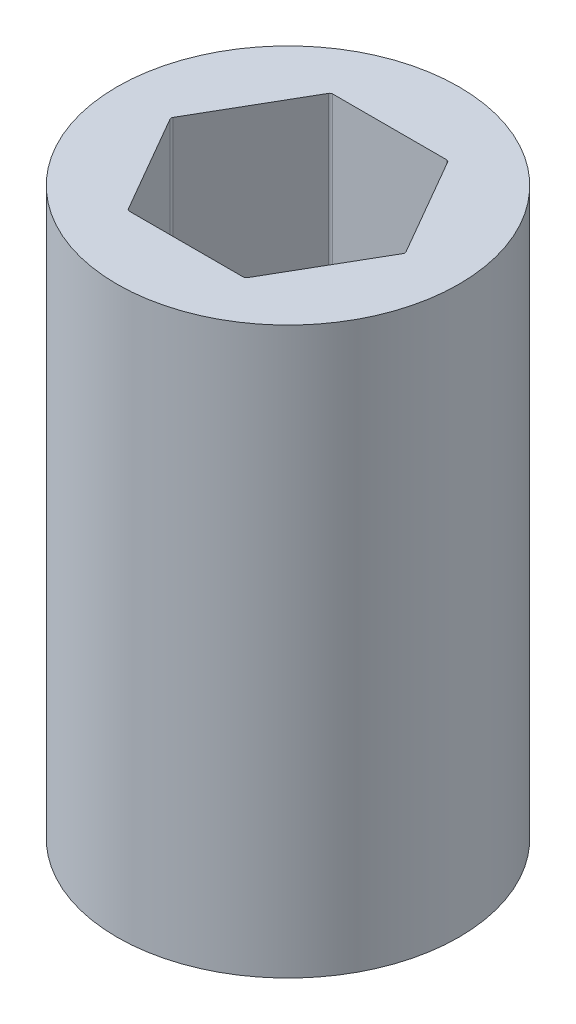
ISO-10303-21;
HEADER;
FILE_DESCRIPTION(('STEP AP214'),'2;1');
FILE_NAME('part.step','',(''),(''),'','','');
FILE_SCHEMA(('AUTOMOTIVE_DESIGN { 1 0 10303 214 1 1 1 1 }'));
ENDSEC;
DATA;
#1=APPLICATION_CONTEXT('core data for automotive mechanical design processes');
#2=APPLICATION_PROTOCOL_DEFINITION('international standard','automotive_design',2000,#1);
#3=PRODUCT_CONTEXT('',#1,'mechanical');
#4=PRODUCT('Part','Part','',(#3));
#5=PRODUCT_RELATED_PRODUCT_CATEGORY('part','',(#4));
#6=PRODUCT_DEFINITION_FORMATION('','',#4);
#7=PRODUCT_DEFINITION_CONTEXT('part definition',#1,'design');
#8=PRODUCT_DEFINITION('design','',#6,#7);
#9=PRODUCT_DEFINITION_SHAPE('','',#8);
#10=(LENGTH_UNIT() NAMED_UNIT(*) SI_UNIT(.MILLI.,.METRE.));
#11=(NAMED_UNIT(*) PLANE_ANGLE_UNIT() SI_UNIT($,.RADIAN.));
#12=(NAMED_UNIT(*) SI_UNIT($,.STERADIAN.) SOLID_ANGLE_UNIT());
#13=UNCERTAINTY_MEASURE_WITH_UNIT(LENGTH_MEASURE(1.E-05),#10,'distance_accuracy_value','');
#14=(GEOMETRIC_REPRESENTATION_CONTEXT(3) GLOBAL_UNCERTAINTY_ASSIGNED_CONTEXT((#13)) GLOBAL_UNIT_ASSIGNED_CONTEXT((#10,
#11,#12)) REPRESENTATION_CONTEXT('',''));
#15=CARTESIAN_POINT('',(0.,0.,0.));
#16=DIRECTION('',(0.,0.,1.));
#17=DIRECTION('',(1.,0.,0.));
#18=AXIS2_PLACEMENT_3D('',#15,#16,#17);
#19=CARTESIAN_POINT('',(0.,36.7538,0.));
#20=DIRECTION('',(0.,1.,0.));
#21=DIRECTION('',(0.,0.,1.));
#22=AXIS2_PLACEMENT_3D('',#19,#20,#21);
#23=PLANE('',#22);
#24=CARTESIAN_POINT('',(0.,36.7538,0.));
#25=DIRECTION('',(0.,1.,0.));
#26=DIRECTION('',(0.,0.,1.));
#27=AXIS2_PLACEMENT_3D('',#24,#25,#26);
#28=CIRCLE('',#27,11.1125);
#29=CARTESIAN_POINT('',(0.,36.7538,11.1125));
#30=VERTEX_POINT('',#29);
#31=EDGE_CURVE('E147',#30,#30,#28,.T.);
#32=ORIENTED_EDGE('',*,*,#31,.T.);
#33=EDGE_LOOP('',(#32));
#34=FACE_BOUND('',#33,.T.);
#35=DIRECTION('',(-0.5,0.,-0.866025403784438));
#36=VECTOR('',#35,1.);
#37=CARTESIAN_POINT('',(7.62564235545658,36.7538,0.));
#38=LINE('',#37,#36);
#39=CARTESIAN_POINT('',(7.56790732853761,36.7538,-0.100000000000002));
#40=VERTEX_POINT('',#39);
#41=CARTESIAN_POINT('',(3.87055620464725,36.7538,-6.504));
#42=VERTEX_POINT('',#41);
#43=EDGE_CURVE('E248',#40,#42,#38,.T.);
#44=ORIENTED_EDGE('',*,*,#43,.F.);
#45=CARTESIAN_POINT('',(7.39470224778073,36.7538,0.));
#46=DIRECTION('',(0.,1.,0.));
#47=DIRECTION('',(0.,0.,1.));
#48=AXIS2_PLACEMENT_3D('',#45,#46,#47);
#49=CIRCLE('',#48,0.2);
#50=CARTESIAN_POINT('',(7.56790732853761,36.7538,0.0999999999999985));
#51=VERTEX_POINT('',#50);
#52=EDGE_CURVE('E50',#40,#51,#49,.F.);
#53=ORIENTED_EDGE('',*,*,#52,.T.);
#54=DIRECTION('',(0.5,0.,-0.866025403784439));
#55=VECTOR('',#54,1.);
#56=CARTESIAN_POINT('',(3.81282117772829,36.7538,6.604));
#57=LINE('',#56,#55);
#58=CARTESIAN_POINT('',(3.87055620464725,36.7538,6.50400000000001));
#59=VERTEX_POINT('',#58);
#60=EDGE_CURVE('E206',#59,#51,#57,.T.);
#61=ORIENTED_EDGE('',*,*,#60,.F.);
#62=CARTESIAN_POINT('',(3.69735112389036,36.7538,6.40400000000001));
#63=DIRECTION('',(0.,1.,0.));
#64=DIRECTION('',(0.,0.,1.));
#65=AXIS2_PLACEMENT_3D('',#62,#63,#64);
#66=CIRCLE('',#65,0.2);
#67=CARTESIAN_POINT('',(3.69735112389036,36.7538,6.604));
#68=VERTEX_POINT('',#67);
#69=EDGE_CURVE('E135',#59,#68,#66,.F.);
#70=ORIENTED_EDGE('',*,*,#69,.T.);
#71=DIRECTION('',(1.,0.,0.));
#72=VECTOR('',#71,1.);
#73=CARTESIAN_POINT('',(-3.81282117772829,36.7538,6.604));
#74=LINE('',#73,#72);
#75=CARTESIAN_POINT('',(-3.69735112389036,36.7538,6.604));
#76=VERTEX_POINT('',#75);
#77=EDGE_CURVE('E213',#76,#68,#74,.T.);
#78=ORIENTED_EDGE('',*,*,#77,.F.);
#79=CARTESIAN_POINT('',(-3.69735112389036,36.7538,6.40400000000001));
#80=DIRECTION('',(0.,1.,0.));
#81=DIRECTION('',(0.,0.,1.));
#82=AXIS2_PLACEMENT_3D('',#79,#80,#81);
#83=CIRCLE('',#82,0.2);
#84=CARTESIAN_POINT('',(-3.87055620464725,36.7538,6.50400000000001));
#85=VERTEX_POINT('',#84);
#86=EDGE_CURVE('E11',#76,#85,#83,.F.);
#87=ORIENTED_EDGE('',*,*,#86,.T.);
#88=DIRECTION('',(0.5,0.,0.866025403784439));
#89=VECTOR('',#88,1.);
#90=CARTESIAN_POINT('',(-7.62564235545658,36.7538,0.));
#91=LINE('',#90,#89);
#92=CARTESIAN_POINT('',(-7.56790732853762,36.7538,0.100000000000001));
#93=VERTEX_POINT('',#92);
#94=EDGE_CURVE('E211',#93,#85,#91,.T.);
#95=ORIENTED_EDGE('',*,*,#94,.F.);
#96=CARTESIAN_POINT('',(-7.39470224778073,36.7538,0.));
#97=DIRECTION('',(0.,1.,0.));
#98=DIRECTION('',(0.,0.,1.));
#99=AXIS2_PLACEMENT_3D('',#96,#97,#98);
#100=CIRCLE('',#99,0.2);
#101=CARTESIAN_POINT('',(-7.56790732853762,36.7538,-0.0999999999999994));
#102=VERTEX_POINT('',#101);
#103=EDGE_CURVE('E188',#93,#102,#100,.F.);
#104=ORIENTED_EDGE('',*,*,#103,.T.);
#105=DIRECTION('',(-0.5,0.,0.866025403784439));
#106=VECTOR('',#105,1.);
#107=CARTESIAN_POINT('',(-3.81282117772829,36.7538,-6.604));
#108=LINE('',#107,#106);
#109=CARTESIAN_POINT('',(-3.87055620464725,36.7538,-6.504));
#110=VERTEX_POINT('',#109);
#111=EDGE_CURVE('E217',#110,#102,#108,.T.);
#112=ORIENTED_EDGE('',*,*,#111,.F.);
#113=CARTESIAN_POINT('',(-3.69735112389037,36.7538,-6.404));
#114=DIRECTION('',(0.,1.,0.));
#115=DIRECTION('',(0.,0.,1.));
#116=AXIS2_PLACEMENT_3D('',#113,#114,#115);
#117=CIRCLE('',#116,0.2);
#118=CARTESIAN_POINT('',(-3.69735112389037,36.7538,-6.604));
#119=VERTEX_POINT('',#118);
#120=EDGE_CURVE('E184',#110,#119,#117,.F.);
#121=ORIENTED_EDGE('',*,*,#120,.T.);
#122=DIRECTION('',(-1.,0.,0.));
#123=VECTOR('',#122,1.);
#124=CARTESIAN_POINT('',(3.81282117772829,36.7538,-6.604));
#125=LINE('',#124,#123);
#126=CARTESIAN_POINT('',(3.69735112389036,36.7538,-6.604));
#127=VERTEX_POINT('',#126);
#128=EDGE_CURVE('E221',#127,#119,#125,.T.);
#129=ORIENTED_EDGE('',*,*,#128,.F.);
#130=CARTESIAN_POINT('',(3.69735112389036,36.7538,-6.404));
#131=DIRECTION('',(0.,1.,0.));
#132=DIRECTION('',(0.,0.,1.));
#133=AXIS2_PLACEMENT_3D('',#130,#131,#132);
#134=CIRCLE('',#133,0.2);
#135=EDGE_CURVE('E180',#127,#42,#134,.F.);
#136=ORIENTED_EDGE('',*,*,#135,.T.);
#137=EDGE_LOOP('',(#44,#53,#61,#70,#78,#87,#95,#104,#112,#121,#129,#136));
#138=FACE_BOUND('',#137,.T.);
#139=ADVANCED_FACE('F35',(#34,#138),#23,.T.);
#140=CARTESIAN_POINT('',(0.,0.,0.));
#141=DIRECTION('',(0.,1.,0.));
#142=DIRECTION('',(0.,0.,1.));
#143=AXIS2_PLACEMENT_3D('',#140,#141,#142);
#144=PLANE('',#143);
#145=CARTESIAN_POINT('',(0.,0.,0.));
#146=DIRECTION('',(0.,1.,0.));
#147=DIRECTION('',(0.,0.,1.));
#148=AXIS2_PLACEMENT_3D('',#145,#146,#147);
#149=CIRCLE('',#148,11.1125);
#150=CARTESIAN_POINT('',(0.,0.,11.1125));
#151=VERTEX_POINT('',#150);
#152=EDGE_CURVE('E152',#151,#151,#149,.T.);
#153=ORIENTED_EDGE('',*,*,#152,.F.);
#154=EDGE_LOOP('',(#153));
#155=FACE_BOUND('',#154,.T.);
#156=DIRECTION('',(1.,0.,0.));
#157=VECTOR('',#156,1.);
#158=CARTESIAN_POINT('',(-3.81282117772829,0.,6.604));
#159=LINE('',#158,#157);
#160=CARTESIAN_POINT('',(-3.69735112389036,0.,6.604));
#161=VERTEX_POINT('',#160);
#162=CARTESIAN_POINT('',(3.69735112389036,0.,6.604));
#163=VERTEX_POINT('',#162);
#164=EDGE_CURVE('E195',#161,#163,#159,.T.);
#165=ORIENTED_EDGE('',*,*,#164,.T.);
#166=CARTESIAN_POINT('',(3.69735112389036,0.,6.40400000000001));
#167=DIRECTION('',(0.,1.,0.));
#168=DIRECTION('',(0.,0.,1.));
#169=AXIS2_PLACEMENT_3D('',#166,#167,#168);
#170=CIRCLE('',#169,0.2);
#171=CARTESIAN_POINT('',(3.87055620464725,0.,6.50400000000001));
#172=VERTEX_POINT('',#171);
#173=EDGE_CURVE('E190',#163,#172,#170,.T.);
#174=ORIENTED_EDGE('',*,*,#173,.T.);
#175=DIRECTION('',(0.5,0.,-0.866025403784439));
#176=VECTOR('',#175,1.);
#177=CARTESIAN_POINT('',(3.81282117772829,0.,6.604));
#178=LINE('',#177,#176);
#179=CARTESIAN_POINT('',(7.56790732853761,0.,0.0999999999999985));
#180=VERTEX_POINT('',#179);
#181=EDGE_CURVE('E130',#172,#180,#178,.T.);
#182=ORIENTED_EDGE('',*,*,#181,.T.);
#183=CARTESIAN_POINT('',(7.39470224778073,0.,0.));
#184=DIRECTION('',(0.,1.,0.));
#185=DIRECTION('',(0.,0.,1.));
#186=AXIS2_PLACEMENT_3D('',#183,#184,#185);
#187=CIRCLE('',#186,0.2);
#188=CARTESIAN_POINT('',(7.56790732853761,0.,-0.100000000000002));
#189=VERTEX_POINT('',#188);
#190=EDGE_CURVE('E125',#180,#189,#187,.T.);
#191=ORIENTED_EDGE('',*,*,#190,.T.);
#192=DIRECTION('',(-0.5,0.,-0.866025403784438));
#193=VECTOR('',#192,1.);
#194=CARTESIAN_POINT('',(7.62564235545658,0.,0.));
#195=LINE('',#194,#193);
#196=CARTESIAN_POINT('',(3.87055620464725,0.,-6.504));
#197=VERTEX_POINT('',#196);
#198=EDGE_CURVE('E129',#189,#197,#195,.T.);
#199=ORIENTED_EDGE('',*,*,#198,.T.);
#200=CARTESIAN_POINT('',(3.69735112389036,0.,-6.404));
#201=DIRECTION('',(0.,1.,0.));
#202=DIRECTION('',(0.,0.,1.));
#203=AXIS2_PLACEMENT_3D('',#200,#201,#202);
#204=CIRCLE('',#203,0.2);
#205=CARTESIAN_POINT('',(3.69735112389036,0.,-6.604));
#206=VERTEX_POINT('',#205);
#207=EDGE_CURVE('E178',#197,#206,#204,.T.);
#208=ORIENTED_EDGE('',*,*,#207,.T.);
#209=DIRECTION('',(-1.,0.,0.));
#210=VECTOR('',#209,1.);
#211=CARTESIAN_POINT('',(3.81282117772829,0.,-6.604));
#212=LINE('',#211,#210);
#213=CARTESIAN_POINT('',(-3.69735112389037,0.,-6.604));
#214=VERTEX_POINT('',#213);
#215=EDGE_CURVE('E144',#206,#214,#212,.T.);
#216=ORIENTED_EDGE('',*,*,#215,.T.);
#217=CARTESIAN_POINT('',(-3.69735112389037,0.,-6.404));
#218=DIRECTION('',(0.,1.,0.));
#219=DIRECTION('',(0.,0.,1.));
#220=AXIS2_PLACEMENT_3D('',#217,#218,#219);
#221=CIRCLE('',#220,0.2);
#222=CARTESIAN_POINT('',(-3.87055620464725,0.,-6.504));
#223=VERTEX_POINT('',#222);
#224=EDGE_CURVE('E182',#214,#223,#221,.T.);
#225=ORIENTED_EDGE('',*,*,#224,.T.);
#226=DIRECTION('',(-0.5,0.,0.866025403784439));
#227=VECTOR('',#226,1.);
#228=CARTESIAN_POINT('',(-3.81282117772829,0.,-6.604));
#229=LINE('',#228,#227);
#230=CARTESIAN_POINT('',(-7.56790732853762,0.,-0.0999999999999994));
#231=VERTEX_POINT('',#230);
#232=EDGE_CURVE('E228',#223,#231,#229,.T.);
#233=ORIENTED_EDGE('',*,*,#232,.T.);
#234=CARTESIAN_POINT('',(-7.39470224778073,0.,0.));
#235=DIRECTION('',(0.,1.,0.));
#236=DIRECTION('',(0.,0.,1.));
#237=AXIS2_PLACEMENT_3D('',#234,#235,#236);
#238=CIRCLE('',#237,0.2);
#239=CARTESIAN_POINT('',(-7.56790732853762,0.,0.100000000000001));
#240=VERTEX_POINT('',#239);
#241=EDGE_CURVE('E186',#231,#240,#238,.T.);
#242=ORIENTED_EDGE('',*,*,#241,.T.);
#243=DIRECTION('',(0.5,0.,0.866025403784439));
#244=VECTOR('',#243,1.);
#245=CARTESIAN_POINT('',(-7.62564235545658,0.,0.));
#246=LINE('',#245,#244);
#247=CARTESIAN_POINT('',(-3.87055620464725,0.,6.50400000000001));
#248=VERTEX_POINT('',#247);
#249=EDGE_CURVE('E197',#240,#248,#246,.T.);
#250=ORIENTED_EDGE('',*,*,#249,.T.);
#251=CARTESIAN_POINT('',(-3.69735112389036,0.,6.40400000000001));
#252=DIRECTION('',(0.,1.,0.));
#253=DIRECTION('',(0.,0.,1.));
#254=AXIS2_PLACEMENT_3D('',#251,#252,#253);
#255=CIRCLE('',#254,0.2);
#256=EDGE_CURVE('E43',#248,#161,#255,.T.);
#257=ORIENTED_EDGE('',*,*,#256,.T.);
#258=EDGE_LOOP('',(#165,#174,#182,#191,#199,#208,#216,#225,#233,#242,#250,#257));
#259=FACE_BOUND('',#258,.T.);
#260=ADVANCED_FACE('F128',(#155,#259),#144,.F.);
#261=CARTESIAN_POINT('',(0.,36.7538,0.));
#262=DIRECTION('',(0.,-1.,0.));
#263=DIRECTION('',(0.,0.,-1.));
#264=AXIS2_PLACEMENT_3D('',#261,#262,#263);
#265=CYLINDRICAL_SURFACE('',#264,11.1125);
#266=ORIENTED_EDGE('',*,*,#31,.F.);
#267=EDGE_LOOP('',(#266));
#268=FACE_BOUND('',#267,.T.);
#269=ORIENTED_EDGE('',*,*,#152,.T.);
#270=EDGE_LOOP('',(#269));
#271=FACE_BOUND('',#270,.T.);
#272=ADVANCED_FACE('F270',(#268,#271),#265,.T.);
#273=CARTESIAN_POINT('',(3.81282117772829,36.7538,6.604));
#274=DIRECTION('',(-0.866025403784439,0.,-0.5));
#275=DIRECTION('',(-0.5,0.,0.866025403784439));
#276=AXIS2_PLACEMENT_3D('',#273,#274,#275);
#277=PLANE('',#276);
#278=ORIENTED_EDGE('',*,*,#181,.F.);
#279=DIRECTION('',(0.,-1.,0.));
#280=VECTOR('',#279,1.);
#281=CARTESIAN_POINT('',(3.87055620464725,36.7538,6.50400000000001));
#282=LINE('',#281,#280);
#283=EDGE_CURVE('E57',#172,#59,#282,.F.);
#284=ORIENTED_EDGE('',*,*,#283,.T.);
#285=ORIENTED_EDGE('',*,*,#60,.T.);
#286=DIRECTION('',(0.,-1.,0.));
#287=VECTOR('',#286,1.);
#288=CARTESIAN_POINT('',(7.56790732853761,0.,0.0999999999999983));
#289=LINE('',#288,#287);
#290=EDGE_CURVE('E175',#51,#180,#289,.T.);
#291=ORIENTED_EDGE('',*,*,#290,.T.);
#292=EDGE_LOOP('',(#278,#284,#285,#291));
#293=FACE_BOUND('',#292,.T.);
#294=ADVANCED_FACE('F251',(#293),#277,.T.);
#295=CARTESIAN_POINT('',(7.62564235545658,36.7538,0.));
#296=DIRECTION('',(-0.866025403784438,0.,0.5));
#297=DIRECTION('',(0.5,0.,0.866025403784439));
#298=AXIS2_PLACEMENT_3D('',#295,#296,#297);
#299=PLANE('',#298);
#300=ORIENTED_EDGE('',*,*,#43,.T.);
#301=DIRECTION('',(0.,-1.,0.));
#302=VECTOR('',#301,1.);
#303=CARTESIAN_POINT('',(3.87055620464725,0.,-6.504));
#304=LINE('',#303,#302);
#305=EDGE_CURVE('E143',#42,#197,#304,.T.);
#306=ORIENTED_EDGE('',*,*,#305,.T.);
#307=ORIENTED_EDGE('',*,*,#198,.F.);
#308=DIRECTION('',(0.,-1.,0.));
#309=VECTOR('',#308,1.);
#310=CARTESIAN_POINT('',(7.56790732853761,36.7538,-0.100000000000002));
#311=LINE('',#310,#309);
#312=EDGE_CURVE('E141',#189,#40,#311,.F.);
#313=ORIENTED_EDGE('',*,*,#312,.T.);
#314=EDGE_LOOP('',(#300,#306,#307,#313));
#315=FACE_BOUND('',#314,.T.);
#316=ADVANCED_FACE('F140',(#315),#299,.T.);
#317=CARTESIAN_POINT('',(3.81282117772829,36.7538,-6.604));
#318=DIRECTION('',(0.,0.,1.));
#319=DIRECTION('',(1.,0.,0.));
#320=AXIS2_PLACEMENT_3D('',#317,#318,#319);
#321=PLANE('',#320);
#322=ORIENTED_EDGE('',*,*,#215,.F.);
#323=DIRECTION('',(0.,-1.,0.));
#324=VECTOR('',#323,1.);
#325=CARTESIAN_POINT('',(3.69735112389036,36.7538,-6.604));
#326=LINE('',#325,#324);
#327=EDGE_CURVE('E158',#206,#127,#326,.F.);
#328=ORIENTED_EDGE('',*,*,#327,.T.);
#329=ORIENTED_EDGE('',*,*,#128,.T.);
#330=DIRECTION('',(0.,-1.,0.));
#331=VECTOR('',#330,1.);
#332=CARTESIAN_POINT('',(-3.69735112389037,0.,-6.604));
#333=LINE('',#332,#331);
#334=EDGE_CURVE('E149',#119,#214,#333,.T.);
#335=ORIENTED_EDGE('',*,*,#334,.T.);
#336=EDGE_LOOP('',(#322,#328,#329,#335));
#337=FACE_BOUND('',#336,.T.);
#338=ADVANCED_FACE('F246',(#337),#321,.T.);
#339=CARTESIAN_POINT('',(-3.81282117772829,36.7538,-6.604));
#340=DIRECTION('',(0.866025403784439,0.,0.5));
#341=DIRECTION('',(0.5,0.,-0.866025403784439));
#342=AXIS2_PLACEMENT_3D('',#339,#340,#341);
#343=PLANE('',#342);
#344=ORIENTED_EDGE('',*,*,#232,.F.);
#345=DIRECTION('',(0.,-1.,0.));
#346=VECTOR('',#345,1.);
#347=CARTESIAN_POINT('',(-3.87055620464725,36.7538,-6.504));
#348=LINE('',#347,#346);
#349=EDGE_CURVE('E163',#223,#110,#348,.F.);
#350=ORIENTED_EDGE('',*,*,#349,.T.);
#351=ORIENTED_EDGE('',*,*,#111,.T.);
#352=DIRECTION('',(0.,-1.,0.));
#353=VECTOR('',#352,1.);
#354=CARTESIAN_POINT('',(-7.56790732853762,0.,-0.0999999999999994));
#355=LINE('',#354,#353);
#356=EDGE_CURVE('E160',#102,#231,#355,.T.);
#357=ORIENTED_EDGE('',*,*,#356,.T.);
#358=EDGE_LOOP('',(#344,#350,#351,#357));
#359=FACE_BOUND('',#358,.T.);
#360=ADVANCED_FACE('F234',(#359),#343,.T.);
#361=CARTESIAN_POINT('',(-7.62564235545658,36.7538,0.));
#362=DIRECTION('',(0.866025403784439,0.,-0.5));
#363=DIRECTION('',(-0.5,0.,-0.866025403784439));
#364=AXIS2_PLACEMENT_3D('',#361,#362,#363);
#365=PLANE('',#364);
#366=ORIENTED_EDGE('',*,*,#249,.F.);
#367=DIRECTION('',(0.,-1.,0.));
#368=VECTOR('',#367,1.);
#369=CARTESIAN_POINT('',(-7.56790732853762,36.7538,0.100000000000001));
#370=LINE('',#369,#368);
#371=EDGE_CURVE('E168',#240,#93,#370,.F.);
#372=ORIENTED_EDGE('',*,*,#371,.T.);
#373=ORIENTED_EDGE('',*,*,#94,.T.);
#374=DIRECTION('',(0.,-1.,0.));
#375=VECTOR('',#374,1.);
#376=CARTESIAN_POINT('',(-3.87055620464725,0.,6.504));
#377=LINE('',#376,#375);
#378=EDGE_CURVE('E165',#85,#248,#377,.T.);
#379=ORIENTED_EDGE('',*,*,#378,.T.);
#380=EDGE_LOOP('',(#366,#372,#373,#379));
#381=FACE_BOUND('',#380,.T.);
#382=ADVANCED_FACE('F215',(#381),#365,.T.);
#383=CARTESIAN_POINT('',(-3.81282117772829,36.7538,6.604));
#384=DIRECTION('',(0.,0.,-1.));
#385=DIRECTION('',(-1.,0.,0.));
#386=AXIS2_PLACEMENT_3D('',#383,#384,#385);
#387=PLANE('',#386);
#388=ORIENTED_EDGE('',*,*,#77,.T.);
#389=DIRECTION('',(0.,-1.,0.));
#390=VECTOR('',#389,1.);
#391=CARTESIAN_POINT('',(3.69735112389036,0.,6.604));
#392=LINE('',#391,#390);
#393=EDGE_CURVE('E172',#68,#163,#392,.T.);
#394=ORIENTED_EDGE('',*,*,#393,.T.);
#395=ORIENTED_EDGE('',*,*,#164,.F.);
#396=DIRECTION('',(0.,-1.,0.));
#397=VECTOR('',#396,1.);
#398=CARTESIAN_POINT('',(-3.69735112389036,36.7538,6.604));
#399=LINE('',#398,#397);
#400=EDGE_CURVE('E170',#161,#76,#399,.F.);
#401=ORIENTED_EDGE('',*,*,#400,.T.);
#402=EDGE_LOOP('',(#388,#394,#395,#401));
#403=FACE_BOUND('',#402,.T.);
#404=ADVANCED_FACE('F203',(#403),#387,.T.);
#405=CARTESIAN_POINT('',(3.69735112389036,36.7538,-6.404));
#406=DIRECTION('',(0.,1.,0.));
#407=DIRECTION('',(0.,0.,1.));
#408=AXIS2_PLACEMENT_3D('',#405,#406,#407);
#409=CYLINDRICAL_SURFACE('',#408,0.2);
#410=ORIENTED_EDGE('',*,*,#135,.F.);
#411=ORIENTED_EDGE('',*,*,#327,.F.);
#412=ORIENTED_EDGE('',*,*,#207,.F.);
#413=ORIENTED_EDGE('',*,*,#305,.F.);
#414=EDGE_LOOP('',(#410,#411,#412,#413));
#415=FACE_BOUND('',#414,.T.);
#416=ADVANCED_FACE('F279',(#415),#409,.F.);
#417=CARTESIAN_POINT('',(-3.69735112389037,36.7538,-6.404));
#418=DIRECTION('',(0.,1.,0.));
#419=DIRECTION('',(0.,0.,1.));
#420=AXIS2_PLACEMENT_3D('',#417,#418,#419);
#421=CYLINDRICAL_SURFACE('',#420,0.2);
#422=ORIENTED_EDGE('',*,*,#120,.F.);
#423=ORIENTED_EDGE('',*,*,#349,.F.);
#424=ORIENTED_EDGE('',*,*,#224,.F.);
#425=ORIENTED_EDGE('',*,*,#334,.F.);
#426=EDGE_LOOP('',(#422,#423,#424,#425));
#427=FACE_BOUND('',#426,.T.);
#428=ADVANCED_FACE('F239',(#427),#421,.F.);
#429=CARTESIAN_POINT('',(-7.39470224778073,36.7538,0.));
#430=DIRECTION('',(0.,1.,0.));
#431=DIRECTION('',(0.,0.,1.));
#432=AXIS2_PLACEMENT_3D('',#429,#430,#431);
#433=CYLINDRICAL_SURFACE('',#432,0.2);
#434=ORIENTED_EDGE('',*,*,#103,.F.);
#435=ORIENTED_EDGE('',*,*,#371,.F.);
#436=ORIENTED_EDGE('',*,*,#241,.F.);
#437=ORIENTED_EDGE('',*,*,#356,.F.);
#438=EDGE_LOOP('',(#434,#435,#436,#437));
#439=FACE_BOUND('',#438,.T.);
#440=ADVANCED_FACE('F256',(#439),#433,.F.);
#441=CARTESIAN_POINT('',(3.69735112389036,36.7538,6.40400000000001));
#442=DIRECTION('',(0.,1.,0.));
#443=DIRECTION('',(0.,0.,1.));
#444=AXIS2_PLACEMENT_3D('',#441,#442,#443);
#445=CYLINDRICAL_SURFACE('',#444,0.2);
#446=ORIENTED_EDGE('',*,*,#69,.F.);
#447=ORIENTED_EDGE('',*,*,#283,.F.);
#448=ORIENTED_EDGE('',*,*,#173,.F.);
#449=ORIENTED_EDGE('',*,*,#393,.F.);
#450=EDGE_LOOP('',(#446,#447,#448,#449));
#451=FACE_BOUND('',#450,.T.);
#452=ADVANCED_FACE('F254',(#451),#445,.F.);
#453=CARTESIAN_POINT('',(7.39470224778073,36.7538,0.));
#454=DIRECTION('',(0.,1.,0.));
#455=DIRECTION('',(0.,0.,1.));
#456=AXIS2_PLACEMENT_3D('',#453,#454,#455);
#457=CYLINDRICAL_SURFACE('',#456,0.2);
#458=ORIENTED_EDGE('',*,*,#52,.F.);
#459=ORIENTED_EDGE('',*,*,#312,.F.);
#460=ORIENTED_EDGE('',*,*,#190,.F.);
#461=ORIENTED_EDGE('',*,*,#290,.F.);
#462=EDGE_LOOP('',(#458,#459,#460,#461));
#463=FACE_BOUND('',#462,.T.);
#464=ADVANCED_FACE('F146',(#463),#457,.F.);
#465=CARTESIAN_POINT('',(-3.69735112389036,36.7538,6.40400000000001));
#466=DIRECTION('',(0.,1.,0.));
#467=DIRECTION('',(0.,0.,1.));
#468=AXIS2_PLACEMENT_3D('',#465,#466,#467);
#469=CYLINDRICAL_SURFACE('',#468,0.2);
#470=ORIENTED_EDGE('',*,*,#86,.F.);
#471=ORIENTED_EDGE('',*,*,#400,.F.);
#472=ORIENTED_EDGE('',*,*,#256,.F.);
#473=ORIENTED_EDGE('',*,*,#378,.F.);
#474=EDGE_LOOP('',(#470,#471,#472,#473));
#475=FACE_BOUND('',#474,.T.);
#476=ADVANCED_FACE('F37',(#475),#469,.F.);
#477=CLOSED_SHELL('',(#139,#260,#272,#294,#316,#338,#360,#382,#404,#416,#428,#440,#452,#464,#476));
#478=MANIFOLD_SOLID_BREP('B2',#477);
#479=ADVANCED_BREP_SHAPE_REPRESENTATION('',(#18,#478),#14);
#480=SHAPE_DEFINITION_REPRESENTATION(#9,#479);
ENDSEC;
END-ISO-10303-21;
